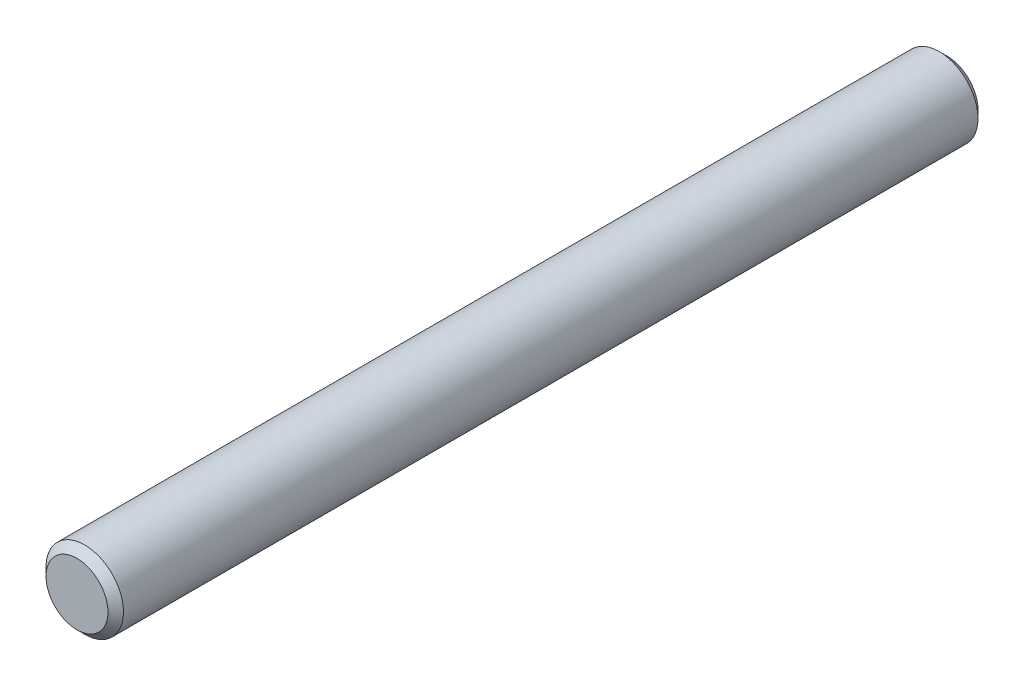
ISO-10303-21;
HEADER;
FILE_DESCRIPTION(('STEP AP214'),'2;1');
FILE_NAME('part.step','',(''),(''),'','','');
FILE_SCHEMA(('AUTOMOTIVE_DESIGN { 1 0 10303 214 1 1 1 1 }'));
ENDSEC;
DATA;
#1=APPLICATION_CONTEXT('core data for automotive mechanical design processes');
#2=APPLICATION_PROTOCOL_DEFINITION('international standard','automotive_design',2000,#1);
#3=PRODUCT_CONTEXT('',#1,'mechanical');
#4=PRODUCT('Part','Part','',(#3));
#5=PRODUCT_RELATED_PRODUCT_CATEGORY('part','',(#4));
#6=PRODUCT_DEFINITION_FORMATION('','',#4);
#7=PRODUCT_DEFINITION_CONTEXT('part definition',#1,'design');
#8=PRODUCT_DEFINITION('design','',#6,#7);
#9=PRODUCT_DEFINITION_SHAPE('','',#8);
#10=(LENGTH_UNIT() NAMED_UNIT(*) SI_UNIT(.MILLI.,.METRE.));
#11=(NAMED_UNIT(*) PLANE_ANGLE_UNIT() SI_UNIT($,.RADIAN.));
#12=(NAMED_UNIT(*) SI_UNIT($,.STERADIAN.) SOLID_ANGLE_UNIT());
#13=UNCERTAINTY_MEASURE_WITH_UNIT(LENGTH_MEASURE(1.E-05),#10,'distance_accuracy_value','');
#14=(GEOMETRIC_REPRESENTATION_CONTEXT(3) GLOBAL_UNCERTAINTY_ASSIGNED_CONTEXT((#13)) GLOBAL_UNIT_ASSIGNED_CONTEXT((#10,
#11,#12)) REPRESENTATION_CONTEXT('',''));
#15=CARTESIAN_POINT('',(0.,0.,0.));
#16=DIRECTION('',(0.,0.,1.));
#17=DIRECTION('',(1.,0.,0.));
#18=AXIS2_PLACEMENT_3D('',#15,#16,#17);
#19=CARTESIAN_POINT('',(0.,0.,53.49875));
#20=DIRECTION('',(0.,0.,-1.));
#21=DIRECTION('',(-1.,0.,0.));
#22=AXIS2_PLACEMENT_3D('',#19,#20,#21);
#23=CYLINDRICAL_SURFACE('',#22,4.7625);
#24=CARTESIAN_POINT('',(0.,0.,-52.54625));
#25=DIRECTION('',(0.,0.,1.));
#26=DIRECTION('',(1.,0.,0.));
#27=AXIS2_PLACEMENT_3D('',#24,#25,#26);
#28=CIRCLE('',#27,4.7625);
#29=CARTESIAN_POINT('',(4.7625,0.,-52.54625));
#30=VERTEX_POINT('',#29);
#31=EDGE_CURVE('E46',#30,#30,#28,.T.);
#32=ORIENTED_EDGE('',*,*,#31,.T.);
#33=EDGE_LOOP('',(#32));
#34=FACE_BOUND('',#33,.T.);
#35=CARTESIAN_POINT('',(0.,0.,52.54625));
#36=DIRECTION('',(0.,0.,1.));
#37=DIRECTION('',(1.,0.,0.));
#38=AXIS2_PLACEMENT_3D('',#35,#36,#37);
#39=CIRCLE('',#38,4.7625);
#40=CARTESIAN_POINT('',(4.7625,0.,52.54625));
#41=VERTEX_POINT('',#40);
#42=EDGE_CURVE('E50',#41,#41,#39,.F.);
#43=ORIENTED_EDGE('',*,*,#42,.T.);
#44=EDGE_LOOP('',(#43));
#45=FACE_BOUND('',#44,.T.);
#46=ADVANCED_FACE('F35',(#34,#45),#23,.T.);
#47=CARTESIAN_POINT('',(0.,0.,53.49875));
#48=DIRECTION('',(0.,0.,1.));
#49=DIRECTION('',(1.,0.,0.));
#50=AXIS2_PLACEMENT_3D('',#47,#48,#49);
#51=PLANE('',#50);
#52=CARTESIAN_POINT('',(0.,0.,53.49875));
#53=DIRECTION('',(0.,0.,1.));
#54=DIRECTION('',(1.,0.,0.));
#55=AXIS2_PLACEMENT_3D('',#52,#53,#54);
#56=CIRCLE('',#55,3.81000000000002);
#57=CARTESIAN_POINT('',(3.81000000000002,0.,53.49875));
#58=VERTEX_POINT('',#57);
#59=EDGE_CURVE('E10',#58,#58,#56,.T.);
#60=ORIENTED_EDGE('',*,*,#59,.T.);
#61=EDGE_LOOP('',(#60));
#62=FACE_BOUND('',#61,.T.);
#63=ADVANCED_FACE('F66',(#62),#51,.T.);
#64=CARTESIAN_POINT('',(0.,0.,-53.49875));
#65=DIRECTION('',(0.,0.,1.));
#66=DIRECTION('',(1.,0.,0.));
#67=AXIS2_PLACEMENT_3D('',#64,#65,#66);
#68=PLANE('',#67);
#69=CARTESIAN_POINT('',(0.,0.,-53.49875));
#70=DIRECTION('',(0.,0.,1.));
#71=DIRECTION('',(1.,0.,0.));
#72=AXIS2_PLACEMENT_3D('',#69,#70,#71);
#73=CIRCLE('',#72,3.80999999999997);
#74=CARTESIAN_POINT('',(3.80999999999997,0.,-53.49875));
#75=VERTEX_POINT('',#74);
#76=EDGE_CURVE('E42',#75,#75,#73,.F.);
#77=ORIENTED_EDGE('',*,*,#76,.T.);
#78=EDGE_LOOP('',(#77));
#79=FACE_BOUND('',#78,.T.);
#80=ADVANCED_FACE('F63',(#79),#68,.F.);
#81=CARTESIAN_POINT('',(0.,0.,-52.54625));
#82=DIRECTION('',(0.,0.,1.));
#83=DIRECTION('',(1.,0.,0.));
#84=AXIS2_PLACEMENT_3D('',#81,#82,#83);
#85=CONICAL_SURFACE('',#84,4.7625,0.785398163397447);
#86=ORIENTED_EDGE('',*,*,#76,.F.);
#87=EDGE_LOOP('',(#86));
#88=FACE_BOUND('',#87,.T.);
#89=ORIENTED_EDGE('',*,*,#31,.F.);
#90=EDGE_LOOP('',(#89));
#91=FACE_BOUND('',#90,.T.);
#92=ADVANCED_FACE('F59',(#88,#91),#85,.T.);
#93=CARTESIAN_POINT('',(0.,0.,53.49875));
#94=DIRECTION('',(0.,0.,-1.));
#95=DIRECTION('',(-1.,0.,0.));
#96=AXIS2_PLACEMENT_3D('',#93,#94,#95);
#97=CONICAL_SURFACE('',#96,3.81000000000002,0.785398163397447);
#98=ORIENTED_EDGE('',*,*,#42,.F.);
#99=EDGE_LOOP('',(#98));
#100=FACE_BOUND('',#99,.T.);
#101=ORIENTED_EDGE('',*,*,#59,.F.);
#102=EDGE_LOOP('',(#101));
#103=FACE_BOUND('',#102,.T.);
#104=ADVANCED_FACE('F37',(#100,#103),#97,.T.);
#105=CLOSED_SHELL('',(#46,#63,#80,#92,#104));
#106=MANIFOLD_SOLID_BREP('B2',#105);
#107=ADVANCED_BREP_SHAPE_REPRESENTATION('',(#18,#106),#14);
#108=SHAPE_DEFINITION_REPRESENTATION(#9,#107);
ENDSEC;
END-ISO-10303-21;
